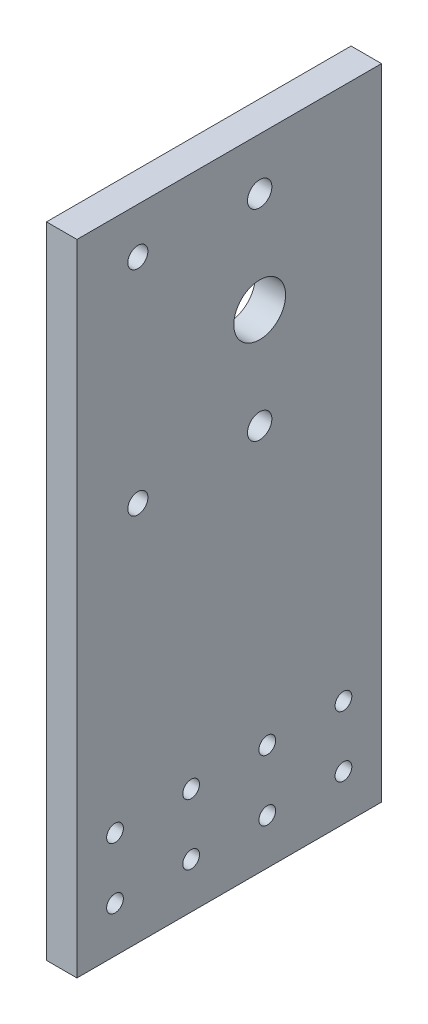
ISO-10303-21;
HEADER;
FILE_DESCRIPTION(('STEP AP214'),'2;1');
FILE_NAME('part.step','',(''),(''),'','','');
FILE_SCHEMA(('AUTOMOTIVE_DESIGN { 1 0 10303 214 1 1 1 1 }'));
ENDSEC;
DATA;
#1=APPLICATION_CONTEXT('core data for automotive mechanical design processes');
#2=APPLICATION_PROTOCOL_DEFINITION('international standard','automotive_design',2000,#1);
#3=PRODUCT_CONTEXT('',#1,'mechanical');
#4=PRODUCT('Part','Part','',(#3));
#5=PRODUCT_RELATED_PRODUCT_CATEGORY('part','',(#4));
#6=PRODUCT_DEFINITION_FORMATION('','',#4);
#7=PRODUCT_DEFINITION_CONTEXT('part definition',#1,'design');
#8=PRODUCT_DEFINITION('design','',#6,#7);
#9=PRODUCT_DEFINITION_SHAPE('','',#8);
#10=(LENGTH_UNIT() NAMED_UNIT(*) SI_UNIT(.MILLI.,.METRE.));
#11=(NAMED_UNIT(*) PLANE_ANGLE_UNIT() SI_UNIT($,.RADIAN.));
#12=(NAMED_UNIT(*) SI_UNIT($,.STERADIAN.) SOLID_ANGLE_UNIT());
#13=UNCERTAINTY_MEASURE_WITH_UNIT(LENGTH_MEASURE(1.E-05),#10,'distance_accuracy_value','');
#14=(GEOMETRIC_REPRESENTATION_CONTEXT(3) GLOBAL_UNCERTAINTY_ASSIGNED_CONTEXT((#13)) GLOBAL_UNIT_ASSIGNED_CONTEXT((#10,
#11,#12)) REPRESENTATION_CONTEXT('',''));
#15=CARTESIAN_POINT('',(0.,0.,0.));
#16=DIRECTION('',(0.,0.,1.));
#17=DIRECTION('',(1.,0.,0.));
#18=AXIS2_PLACEMENT_3D('',#15,#16,#17);
#19=CARTESIAN_POINT('',(0.,0.,0.));
#20=DIRECTION('',(1.,0.,0.));
#21=DIRECTION('',(0.,0.,-1.));
#22=AXIS2_PLACEMENT_3D('',#19,#20,#21);
#23=PLANE('',#22);
#24=CARTESIAN_POINT('',(0.,-70.,-27.5));
#25=DIRECTION('',(-1.,0.,0.));
#26=DIRECTION('',(0.,0.,1.));
#27=AXIS2_PLACEMENT_3D('',#24,#25,#26);
#28=CIRCLE('',#27,5.735);
#29=CARTESIAN_POINT('',(0.,-70.,-21.765));
#30=VERTEX_POINT('',#29);
#31=EDGE_CURVE('E461',#30,#30,#28,.T.);
#32=ORIENTED_EDGE('',*,*,#31,.F.);
#33=EDGE_LOOP('',(#32));
#34=FACE_BOUND('',#33,.T.);
#35=CARTESIAN_POINT('',(0.,22.,0.));
#36=DIRECTION('',(1.,0.,0.));
#37=DIRECTION('',(0.,0.,1.));
#38=AXIS2_PLACEMENT_3D('',#35,#36,#37);
#39=CIRCLE('',#38,4.);
#40=CARTESIAN_POINT('',(0.,22.,4.));
#41=VERTEX_POINT('',#40);
#42=EDGE_CURVE('E203',#41,#41,#39,.T.);
#43=ORIENTED_EDGE('',*,*,#42,.T.);
#44=EDGE_LOOP('',(#43));
#45=FACE_BOUND('',#44,.T.);
#46=CARTESIAN_POINT('',(0.,88.,0.));
#47=DIRECTION('',(1.,0.,0.));
#48=DIRECTION('',(0.,0.,-1.));
#49=AXIS2_PLACEMENT_3D('',#46,#47,#48);
#50=CIRCLE('',#49,4.00000000000001);
#51=CARTESIAN_POINT('',(0.,88.,-4.00000000000001));
#52=VERTEX_POINT('',#51);
#53=EDGE_CURVE('E209',#52,#52,#50,.T.);
#54=ORIENTED_EDGE('',*,*,#53,.T.);
#55=EDGE_LOOP('',(#54));
#56=FACE_BOUND('',#55,.T.);
#57=DIRECTION('',(0.,-1.,0.));
#58=VECTOR('',#57,1.);
#59=CARTESIAN_POINT('',(0.,-105.,60.));
#60=LINE('',#59,#58);
#61=CARTESIAN_POINT('',(0.,105.,60.));
#62=VERTEX_POINT('',#61);
#63=CARTESIAN_POINT('',(0.,-105.,60.));
#64=VERTEX_POINT('',#63);
#65=EDGE_CURVE('E105',#62,#64,#60,.T.);
#66=ORIENTED_EDGE('',*,*,#65,.F.);
#67=DIRECTION('',(0.,0.,1.));
#68=VECTOR('',#67,1.);
#69=CARTESIAN_POINT('',(0.,105.,-40.));
#70=LINE('',#69,#68);
#71=CARTESIAN_POINT('',(0.,105.,-40.));
#72=VERTEX_POINT('',#71);
#73=EDGE_CURVE('E79',#72,#62,#70,.T.);
#74=ORIENTED_EDGE('',*,*,#73,.F.);
#75=DIRECTION('',(0.,1.,0.));
#76=VECTOR('',#75,1.);
#77=CARTESIAN_POINT('',(0.,-105.,-40.));
#78=LINE('',#77,#76);
#79=CARTESIAN_POINT('',(0.,-105.,-40.));
#80=VERTEX_POINT('',#79);
#81=EDGE_CURVE('E73',#80,#72,#78,.T.);
#82=ORIENTED_EDGE('',*,*,#81,.F.);
#83=DIRECTION('',(0.,0.,-1.));
#84=VECTOR('',#83,1.);
#85=CARTESIAN_POINT('',(0.,-105.,-40.));
#86=LINE('',#85,#84);
#87=EDGE_CURVE('E96',#64,#80,#86,.T.);
#88=ORIENTED_EDGE('',*,*,#87,.F.);
#89=EDGE_LOOP('',(#66,#74,#82,#88));
#90=FACE_BOUND('',#89,.T.);
#91=CARTESIAN_POINT('',(0.,55.,0.));
#92=DIRECTION('',(1.,0.,0.));
#93=DIRECTION('',(0.,0.,-1.));
#94=AXIS2_PLACEMENT_3D('',#91,#92,#93);
#95=CIRCLE('',#94,8.5);
#96=CARTESIAN_POINT('',(0.,55.,-8.5));
#97=VERTEX_POINT('',#96);
#98=EDGE_CURVE('E200',#97,#97,#95,.T.);
#99=ORIENTED_EDGE('',*,*,#98,.T.);
#100=EDGE_LOOP('',(#99));
#101=FACE_BOUND('',#100,.T.);
#102=CARTESIAN_POINT('',(0.,19.9999999999999,40.));
#103=DIRECTION('',(-1.,0.,0.));
#104=DIRECTION('',(0.,0.,1.));
#105=AXIS2_PLACEMENT_3D('',#102,#103,#104);
#106=CIRCLE('',#105,6.855);
#107=CARTESIAN_POINT('',(0.,19.9999999999999,46.855));
#108=VERTEX_POINT('',#107);
#109=EDGE_CURVE('E122',#108,#108,#106,.T.);
#110=ORIENTED_EDGE('',*,*,#109,.F.);
#111=EDGE_LOOP('',(#110));
#112=FACE_BOUND('',#111,.T.);
#113=CARTESIAN_POINT('',(0.,90.,40.));
#114=DIRECTION('',(-1.,0.,0.));
#115=DIRECTION('',(0.,0.,1.));
#116=AXIS2_PLACEMENT_3D('',#113,#114,#115);
#117=CIRCLE('',#116,6.855);
#118=CARTESIAN_POINT('',(0.,90.,46.855));
#119=VERTEX_POINT('',#118);
#120=EDGE_CURVE('E127',#119,#119,#117,.T.);
#121=ORIENTED_EDGE('',*,*,#120,.F.);
#122=EDGE_LOOP('',(#121));
#123=FACE_BOUND('',#122,.T.);
#124=CARTESIAN_POINT('',(0.,-90.,-27.5));
#125=DIRECTION('',(-1.,0.,0.));
#126=DIRECTION('',(0.,0.,1.));
#127=AXIS2_PLACEMENT_3D('',#124,#125,#126);
#128=CIRCLE('',#127,5.735);
#129=CARTESIAN_POINT('',(0.,-90.,-21.765));
#130=VERTEX_POINT('',#129);
#131=EDGE_CURVE('E132',#130,#130,#128,.T.);
#132=ORIENTED_EDGE('',*,*,#131,.F.);
#133=EDGE_LOOP('',(#132));
#134=FACE_BOUND('',#133,.T.);
#135=CARTESIAN_POINT('',(0.,-90.,-2.5));
#136=DIRECTION('',(-1.,0.,0.));
#137=DIRECTION('',(0.,0.,1.));
#138=AXIS2_PLACEMENT_3D('',#135,#136,#137);
#139=CIRCLE('',#138,5.735);
#140=CARTESIAN_POINT('',(0.,-90.,3.23500000000001));
#141=VERTEX_POINT('',#140);
#142=EDGE_CURVE('E137',#141,#141,#139,.T.);
#143=ORIENTED_EDGE('',*,*,#142,.F.);
#144=EDGE_LOOP('',(#143));
#145=FACE_BOUND('',#144,.T.);
#146=CARTESIAN_POINT('',(0.,-90.,22.5));
#147=DIRECTION('',(-1.,0.,0.));
#148=DIRECTION('',(0.,0.,1.));
#149=AXIS2_PLACEMENT_3D('',#146,#147,#148);
#150=CIRCLE('',#149,5.735);
#151=CARTESIAN_POINT('',(0.,-90.,28.235));
#152=VERTEX_POINT('',#151);
#153=EDGE_CURVE('E142',#152,#152,#150,.T.);
#154=ORIENTED_EDGE('',*,*,#153,.F.);
#155=EDGE_LOOP('',(#154));
#156=FACE_BOUND('',#155,.T.);
#157=CARTESIAN_POINT('',(0.,-90.,47.5));
#158=DIRECTION('',(-1.,0.,0.));
#159=DIRECTION('',(0.,0.,1.));
#160=AXIS2_PLACEMENT_3D('',#157,#158,#159);
#161=CIRCLE('',#160,5.735);
#162=CARTESIAN_POINT('',(0.,-90.,53.235));
#163=VERTEX_POINT('',#162);
#164=EDGE_CURVE('E147',#163,#163,#161,.T.);
#165=ORIENTED_EDGE('',*,*,#164,.F.);
#166=EDGE_LOOP('',(#165));
#167=FACE_BOUND('',#166,.T.);
#168=CARTESIAN_POINT('',(0.,-70.,47.5));
#169=DIRECTION('',(-1.,0.,0.));
#170=DIRECTION('',(0.,0.,1.));
#171=AXIS2_PLACEMENT_3D('',#168,#169,#170);
#172=CIRCLE('',#171,5.735);
#173=CARTESIAN_POINT('',(0.,-70.,53.235));
#174=VERTEX_POINT('',#173);
#175=EDGE_CURVE('E151',#174,#174,#172,.T.);
#176=ORIENTED_EDGE('',*,*,#175,.F.);
#177=EDGE_LOOP('',(#176));
#178=FACE_BOUND('',#177,.T.);
#179=CARTESIAN_POINT('',(0.,-70.,22.5));
#180=DIRECTION('',(-1.,0.,0.));
#181=DIRECTION('',(0.,0.,1.));
#182=AXIS2_PLACEMENT_3D('',#179,#180,#181);
#183=CIRCLE('',#182,5.735);
#184=CARTESIAN_POINT('',(0.,-70.,28.235));
#185=VERTEX_POINT('',#184);
#186=EDGE_CURVE('E155',#185,#185,#183,.T.);
#187=ORIENTED_EDGE('',*,*,#186,.F.);
#188=EDGE_LOOP('',(#187));
#189=FACE_BOUND('',#188,.T.);
#190=CARTESIAN_POINT('',(0.,-70.,-2.5));
#191=DIRECTION('',(-1.,0.,0.));
#192=DIRECTION('',(0.,0.,1.));
#193=AXIS2_PLACEMENT_3D('',#190,#191,#192);
#194=CIRCLE('',#193,5.735);
#195=CARTESIAN_POINT('',(0.,-70.,3.23500000000001));
#196=VERTEX_POINT('',#195);
#197=EDGE_CURVE('E162',#196,#196,#194,.T.);
#198=ORIENTED_EDGE('',*,*,#197,.F.);
#199=EDGE_LOOP('',(#198));
#200=FACE_BOUND('',#199,.T.);
#201=ADVANCED_FACE('F37',(#34,#45,#56,#90,#101,#112,#123,#134,#145,#156,#167,#178,#189,#200),
#23,.F.);
#202=CARTESIAN_POINT('',(10.,0.,0.));
#203=DIRECTION('',(1.,0.,0.));
#204=DIRECTION('',(0.,0.,-1.));
#205=AXIS2_PLACEMENT_3D('',#202,#203,#204);
#206=PLANE('',#205);
#207=CARTESIAN_POINT('',(10.,-70.,-27.5));
#208=DIRECTION('',(1.,0.,0.));
#209=DIRECTION('',(0.,0.,-1.));
#210=AXIS2_PLACEMENT_3D('',#207,#208,#209);
#211=CIRCLE('',#210,2.75);
#212=CARTESIAN_POINT('',(10.,-70.,-30.25));
#213=VERTEX_POINT('',#212);
#214=EDGE_CURVE('E41',#213,#213,#211,.T.);
#215=ORIENTED_EDGE('',*,*,#214,.F.);
#216=EDGE_LOOP('',(#215));
#217=FACE_BOUND('',#216,.T.);
#218=CARTESIAN_POINT('',(10.,-70.,-2.5));
#219=DIRECTION('',(1.,0.,0.));
#220=DIRECTION('',(0.,0.,-1.));
#221=AXIS2_PLACEMENT_3D('',#218,#219,#220);
#222=CIRCLE('',#221,2.75);
#223=CARTESIAN_POINT('',(10.,-70.,-5.25));
#224=VERTEX_POINT('',#223);
#225=EDGE_CURVE('E153',#224,#224,#222,.T.);
#226=ORIENTED_EDGE('',*,*,#225,.F.);
#227=EDGE_LOOP('',(#226));
#228=FACE_BOUND('',#227,.T.);
#229=CARTESIAN_POINT('',(10.,-70.,22.5));
#230=DIRECTION('',(1.,0.,0.));
#231=DIRECTION('',(0.,0.,-1.));
#232=AXIS2_PLACEMENT_3D('',#229,#230,#231);
#233=CIRCLE('',#232,2.75);
#234=CARTESIAN_POINT('',(10.,-70.,19.75));
#235=VERTEX_POINT('',#234);
#236=EDGE_CURVE('E149',#235,#235,#233,.T.);
#237=ORIENTED_EDGE('',*,*,#236,.F.);
#238=EDGE_LOOP('',(#237));
#239=FACE_BOUND('',#238,.T.);
#240=CARTESIAN_POINT('',(10.,-70.,47.5));
#241=DIRECTION('',(1.,0.,0.));
#242=DIRECTION('',(0.,0.,-1.));
#243=AXIS2_PLACEMENT_3D('',#240,#241,#242);
#244=CIRCLE('',#243,2.75);
#245=CARTESIAN_POINT('',(10.,-70.,44.75));
#246=VERTEX_POINT('',#245);
#247=EDGE_CURVE('E144',#246,#246,#244,.T.);
#248=ORIENTED_EDGE('',*,*,#247,.F.);
#249=EDGE_LOOP('',(#248));
#250=FACE_BOUND('',#249,.T.);
#251=CARTESIAN_POINT('',(10.,-90.,47.5));
#252=DIRECTION('',(1.,0.,0.));
#253=DIRECTION('',(0.,0.,-1.));
#254=AXIS2_PLACEMENT_3D('',#251,#252,#253);
#255=CIRCLE('',#254,2.75);
#256=CARTESIAN_POINT('',(10.,-90.,44.75));
#257=VERTEX_POINT('',#256);
#258=EDGE_CURVE('E139',#257,#257,#255,.T.);
#259=ORIENTED_EDGE('',*,*,#258,.F.);
#260=EDGE_LOOP('',(#259));
#261=FACE_BOUND('',#260,.T.);
#262=CARTESIAN_POINT('',(10.,-90.,22.5));
#263=DIRECTION('',(1.,0.,0.));
#264=DIRECTION('',(0.,0.,-1.));
#265=AXIS2_PLACEMENT_3D('',#262,#263,#264);
#266=CIRCLE('',#265,2.75);
#267=CARTESIAN_POINT('',(10.,-90.,19.75));
#268=VERTEX_POINT('',#267);
#269=EDGE_CURVE('E134',#268,#268,#266,.T.);
#270=ORIENTED_EDGE('',*,*,#269,.F.);
#271=EDGE_LOOP('',(#270));
#272=FACE_BOUND('',#271,.T.);
#273=CARTESIAN_POINT('',(10.,-90.,-2.5));
#274=DIRECTION('',(1.,0.,0.));
#275=DIRECTION('',(0.,0.,-1.));
#276=AXIS2_PLACEMENT_3D('',#273,#274,#275);
#277=CIRCLE('',#276,2.75);
#278=CARTESIAN_POINT('',(10.,-90.,-5.25));
#279=VERTEX_POINT('',#278);
#280=EDGE_CURVE('E129',#279,#279,#277,.T.);
#281=ORIENTED_EDGE('',*,*,#280,.F.);
#282=EDGE_LOOP('',(#281));
#283=FACE_BOUND('',#282,.T.);
#284=CARTESIAN_POINT('',(10.,-90.,-27.5));
#285=DIRECTION('',(1.,0.,0.));
#286=DIRECTION('',(0.,0.,-1.));
#287=AXIS2_PLACEMENT_3D('',#284,#285,#286);
#288=CIRCLE('',#287,2.75);
#289=CARTESIAN_POINT('',(10.,-90.,-30.25));
#290=VERTEX_POINT('',#289);
#291=EDGE_CURVE('E124',#290,#290,#288,.T.);
#292=ORIENTED_EDGE('',*,*,#291,.F.);
#293=EDGE_LOOP('',(#292));
#294=FACE_BOUND('',#293,.T.);
#295=CARTESIAN_POINT('',(10.,90.,40.));
#296=DIRECTION('',(1.,0.,0.));
#297=DIRECTION('',(0.,0.,-1.));
#298=AXIS2_PLACEMENT_3D('',#295,#296,#297);
#299=CIRCLE('',#298,3.3);
#300=CARTESIAN_POINT('',(10.,90.,36.7));
#301=VERTEX_POINT('',#300);
#302=EDGE_CURVE('E119',#301,#301,#299,.T.);
#303=ORIENTED_EDGE('',*,*,#302,.F.);
#304=EDGE_LOOP('',(#303));
#305=FACE_BOUND('',#304,.T.);
#306=CARTESIAN_POINT('',(10.,19.9999999999999,40.));
#307=DIRECTION('',(1.,0.,0.));
#308=DIRECTION('',(0.,0.,-1.));
#309=AXIS2_PLACEMENT_3D('',#306,#307,#308);
#310=CIRCLE('',#309,3.3);
#311=CARTESIAN_POINT('',(10.,19.9999999999999,36.7));
#312=VERTEX_POINT('',#311);
#313=EDGE_CURVE('E114',#312,#312,#310,.T.);
#314=ORIENTED_EDGE('',*,*,#313,.F.);
#315=EDGE_LOOP('',(#314));
#316=FACE_BOUND('',#315,.T.);
#317=CARTESIAN_POINT('',(10.,55.,0.));
#318=DIRECTION('',(1.,0.,0.));
#319=DIRECTION('',(0.,0.,-1.));
#320=AXIS2_PLACEMENT_3D('',#317,#318,#319);
#321=CIRCLE('',#320,8.5);
#322=CARTESIAN_POINT('',(10.,55.,-8.5));
#323=VERTEX_POINT('',#322);
#324=EDGE_CURVE('E117',#323,#323,#321,.T.);
#325=ORIENTED_EDGE('',*,*,#324,.F.);
#326=EDGE_LOOP('',(#325));
#327=FACE_BOUND('',#326,.T.);
#328=CARTESIAN_POINT('',(10.,88.,0.));
#329=DIRECTION('',(1.,0.,0.));
#330=DIRECTION('',(0.,0.,-1.));
#331=AXIS2_PLACEMENT_3D('',#328,#329,#330);
#332=CIRCLE('',#331,4.00000000000001);
#333=CARTESIAN_POINT('',(10.,88.,-4.00000000000001));
#334=VERTEX_POINT('',#333);
#335=EDGE_CURVE('E108',#334,#334,#332,.T.);
#336=ORIENTED_EDGE('',*,*,#335,.F.);
#337=EDGE_LOOP('',(#336));
#338=FACE_BOUND('',#337,.T.);
#339=DIRECTION('',(0.,-1.,0.));
#340=VECTOR('',#339,1.);
#341=CARTESIAN_POINT('',(10.,-105.,60.));
#342=LINE('',#341,#340);
#343=CARTESIAN_POINT('',(10.,105.,60.));
#344=VERTEX_POINT('',#343);
#345=CARTESIAN_POINT('',(10.,-105.,60.));
#346=VERTEX_POINT('',#345);
#347=EDGE_CURVE('E92',#344,#346,#342,.T.);
#348=ORIENTED_EDGE('',*,*,#347,.T.);
#349=DIRECTION('',(0.,0.,-1.));
#350=VECTOR('',#349,1.);
#351=CARTESIAN_POINT('',(10.,-105.,-40.));
#352=LINE('',#351,#350);
#353=CARTESIAN_POINT('',(10.,-105.,-40.));
#354=VERTEX_POINT('',#353);
#355=EDGE_CURVE('E86',#346,#354,#352,.T.);
#356=ORIENTED_EDGE('',*,*,#355,.T.);
#357=DIRECTION('',(0.,1.,0.));
#358=VECTOR('',#357,1.);
#359=CARTESIAN_POINT('',(10.,-105.,-40.));
#360=LINE('',#359,#358);
#361=CARTESIAN_POINT('',(10.,105.,-40.));
#362=VERTEX_POINT('',#361);
#363=EDGE_CURVE('E90',#354,#362,#360,.T.);
#364=ORIENTED_EDGE('',*,*,#363,.T.);
#365=DIRECTION('',(0.,0.,1.));
#366=VECTOR('',#365,1.);
#367=CARTESIAN_POINT('',(10.,105.,-40.));
#368=LINE('',#367,#366);
#369=EDGE_CURVE('E56',#362,#344,#368,.T.);
#370=ORIENTED_EDGE('',*,*,#369,.T.);
#371=EDGE_LOOP('',(#348,#356,#364,#370));
#372=FACE_BOUND('',#371,.T.);
#373=CARTESIAN_POINT('',(10.,22.,0.));
#374=DIRECTION('',(1.,0.,0.));
#375=DIRECTION('',(0.,0.,1.));
#376=AXIS2_PLACEMENT_3D('',#373,#374,#375);
#377=CIRCLE('',#376,4.);
#378=CARTESIAN_POINT('',(10.,22.,4.));
#379=VERTEX_POINT('',#378);
#380=EDGE_CURVE('E206',#379,#379,#377,.T.);
#381=ORIENTED_EDGE('',*,*,#380,.F.);
#382=EDGE_LOOP('',(#381));
#383=FACE_BOUND('',#382,.T.);
#384=ADVANCED_FACE('F87',(#217,#228,#239,#250,#261,#272,#283,#294,#305,#316,#327,#338,#372,
#383),#206,.T.);
#385=CARTESIAN_POINT('',(10.,-105.,60.));
#386=DIRECTION('',(0.,0.,-1.));
#387=DIRECTION('',(-1.,0.,0.));
#388=AXIS2_PLACEMENT_3D('',#385,#386,#387);
#389=PLANE('',#388);
#390=ORIENTED_EDGE('',*,*,#65,.T.);
#391=DIRECTION('',(-1.,0.,0.));
#392=VECTOR('',#391,1.);
#393=CARTESIAN_POINT('',(10.,-105.,60.));
#394=LINE('',#393,#392);
#395=EDGE_CURVE('E11',#346,#64,#394,.T.);
#396=ORIENTED_EDGE('',*,*,#395,.F.);
#397=ORIENTED_EDGE('',*,*,#347,.F.);
#398=DIRECTION('',(-1.,0.,0.));
#399=VECTOR('',#398,1.);
#400=CARTESIAN_POINT('',(10.,105.,60.));
#401=LINE('',#400,#399);
#402=EDGE_CURVE('E101',#344,#62,#401,.T.);
#403=ORIENTED_EDGE('',*,*,#402,.T.);
#404=EDGE_LOOP('',(#390,#396,#397,#403));
#405=FACE_BOUND('',#404,.T.);
#406=ADVANCED_FACE('F39',(#405),#389,.F.);
#407=CARTESIAN_POINT('',(10.,-105.,-40.));
#408=DIRECTION('',(0.,1.,0.));
#409=DIRECTION('',(0.,0.,1.));
#410=AXIS2_PLACEMENT_3D('',#407,#408,#409);
#411=PLANE('',#410);
#412=ORIENTED_EDGE('',*,*,#87,.T.);
#413=DIRECTION('',(-1.,0.,0.));
#414=VECTOR('',#413,1.);
#415=CARTESIAN_POINT('',(10.,-105.,-40.));
#416=LINE('',#415,#414);
#417=EDGE_CURVE('E47',#354,#80,#416,.T.);
#418=ORIENTED_EDGE('',*,*,#417,.F.);
#419=ORIENTED_EDGE('',*,*,#355,.F.);
#420=ORIENTED_EDGE('',*,*,#395,.T.);
#421=EDGE_LOOP('',(#412,#418,#419,#420));
#422=FACE_BOUND('',#421,.T.);
#423=ADVANCED_FACE('F95',(#422),#411,.F.);
#424=CARTESIAN_POINT('',(10.,-105.,-40.));
#425=DIRECTION('',(0.,0.,1.));
#426=DIRECTION('',(1.,0.,0.));
#427=AXIS2_PLACEMENT_3D('',#424,#425,#426);
#428=PLANE('',#427);
#429=ORIENTED_EDGE('',*,*,#81,.T.);
#430=DIRECTION('',(-1.,0.,0.));
#431=VECTOR('',#430,1.);
#432=CARTESIAN_POINT('',(10.,105.,-40.));
#433=LINE('',#432,#431);
#434=EDGE_CURVE('E97',#362,#72,#433,.T.);
#435=ORIENTED_EDGE('',*,*,#434,.F.);
#436=ORIENTED_EDGE('',*,*,#363,.F.);
#437=ORIENTED_EDGE('',*,*,#417,.T.);
#438=EDGE_LOOP('',(#429,#435,#436,#437));
#439=FACE_BOUND('',#438,.T.);
#440=ADVANCED_FACE('F99',(#439),#428,.F.);
#441=CARTESIAN_POINT('',(10.,105.,-40.));
#442=DIRECTION('',(0.,-1.,0.));
#443=DIRECTION('',(0.,0.,-1.));
#444=AXIS2_PLACEMENT_3D('',#441,#442,#443);
#445=PLANE('',#444);
#446=ORIENTED_EDGE('',*,*,#73,.T.);
#447=ORIENTED_EDGE('',*,*,#402,.F.);
#448=ORIENTED_EDGE('',*,*,#369,.F.);
#449=ORIENTED_EDGE('',*,*,#434,.T.);
#450=EDGE_LOOP('',(#446,#447,#448,#449));
#451=FACE_BOUND('',#450,.T.);
#452=ADVANCED_FACE('F222',(#451),#445,.F.);
#453=CARTESIAN_POINT('',(10.,88.,0.));
#454=DIRECTION('',(-1.,0.,0.));
#455=DIRECTION('',(0.,0.,1.));
#456=AXIS2_PLACEMENT_3D('',#453,#454,#455);
#457=CYLINDRICAL_SURFACE('',#456,4.00000000000001);
#458=ORIENTED_EDGE('',*,*,#335,.T.);
#459=EDGE_LOOP('',(#458));
#460=FACE_BOUND('',#459,.T.);
#461=ORIENTED_EDGE('',*,*,#53,.F.);
#462=EDGE_LOOP('',(#461));
#463=FACE_BOUND('',#462,.T.);
#464=ADVANCED_FACE('F219',(#460,#463),#457,.F.);
#465=CARTESIAN_POINT('',(10.,22.,0.));
#466=DIRECTION('',(-1.,0.,0.));
#467=DIRECTION('',(0.,0.,1.));
#468=AXIS2_PLACEMENT_3D('',#465,#466,#467);
#469=CYLINDRICAL_SURFACE('',#468,4.);
#470=ORIENTED_EDGE('',*,*,#380,.T.);
#471=EDGE_LOOP('',(#470));
#472=FACE_BOUND('',#471,.T.);
#473=ORIENTED_EDGE('',*,*,#42,.F.);
#474=EDGE_LOOP('',(#473));
#475=FACE_BOUND('',#474,.T.);
#476=ADVANCED_FACE('F221',(#472,#475),#469,.F.);
#477=CARTESIAN_POINT('',(0.,55.,0.));
#478=DIRECTION('',(1.,0.,0.));
#479=DIRECTION('',(0.,0.,-1.));
#480=AXIS2_PLACEMENT_3D('',#477,#478,#479);
#481=CYLINDRICAL_SURFACE('',#480,8.5);
#482=ORIENTED_EDGE('',*,*,#98,.F.);
#483=EDGE_LOOP('',(#482));
#484=FACE_BOUND('',#483,.T.);
#485=ORIENTED_EDGE('',*,*,#324,.T.);
#486=EDGE_LOOP('',(#485));
#487=FACE_BOUND('',#486,.T.);
#488=ADVANCED_FACE('F229',(#484,#487),#481,.F.);
#489=CARTESIAN_POINT('',(0.,19.9999999999999,40.));
#490=DIRECTION('',(-1.,0.,0.));
#491=DIRECTION('',(0.,0.,1.));
#492=AXIS2_PLACEMENT_3D('',#489,#490,#491);
#493=CYLINDRICAL_SURFACE('',#492,3.3);
#494=ORIENTED_EDGE('',*,*,#313,.T.);
#495=EDGE_LOOP('',(#494));
#496=FACE_BOUND('',#495,.T.);
#497=CARTESIAN_POINT('',(3.555,19.9999999999999,40.));
#498=DIRECTION('',(-1.,0.,0.));
#499=DIRECTION('',(0.,0.,1.));
#500=AXIS2_PLACEMENT_3D('',#497,#498,#499);
#501=CIRCLE('',#500,3.3);
#502=CARTESIAN_POINT('',(3.555,19.9999999999999,43.3));
#503=VERTEX_POINT('',#502);
#504=EDGE_CURVE('E118',#503,#503,#501,.T.);
#505=ORIENTED_EDGE('',*,*,#504,.T.);
#506=EDGE_LOOP('',(#505));
#507=FACE_BOUND('',#506,.T.);
#508=ADVANCED_FACE('F349',(#496,#507),#493,.F.);
#509=CARTESIAN_POINT('',(0.,19.9999999999999,40.));
#510=DIRECTION('',(-1.,0.,0.));
#511=DIRECTION('',(0.,0.,1.));
#512=AXIS2_PLACEMENT_3D('',#509,#510,#511);
#513=CONICAL_SURFACE('',#512,6.855,0.785398163397448);
#514=ORIENTED_EDGE('',*,*,#504,.F.);
#515=EDGE_LOOP('',(#514));
#516=FACE_BOUND('',#515,.T.);
#517=ORIENTED_EDGE('',*,*,#109,.T.);
#518=EDGE_LOOP('',(#517));
#519=FACE_BOUND('',#518,.T.);
#520=ADVANCED_FACE('F345',(#516,#519),#513,.F.);
#521=CARTESIAN_POINT('',(0.,90.,40.));
#522=DIRECTION('',(-1.,0.,0.));
#523=DIRECTION('',(0.,0.,1.));
#524=AXIS2_PLACEMENT_3D('',#521,#522,#523);
#525=CYLINDRICAL_SURFACE('',#524,3.3);
#526=ORIENTED_EDGE('',*,*,#302,.T.);
#527=EDGE_LOOP('',(#526));
#528=FACE_BOUND('',#527,.T.);
#529=CARTESIAN_POINT('',(3.555,90.,40.));
#530=DIRECTION('',(-1.,0.,0.));
#531=DIRECTION('',(0.,0.,1.));
#532=AXIS2_PLACEMENT_3D('',#529,#530,#531);
#533=CIRCLE('',#532,3.3);
#534=CARTESIAN_POINT('',(3.555,90.,43.3));
#535=VERTEX_POINT('',#534);
#536=EDGE_CURVE('E123',#535,#535,#533,.T.);
#537=ORIENTED_EDGE('',*,*,#536,.T.);
#538=EDGE_LOOP('',(#537));
#539=FACE_BOUND('',#538,.T.);
#540=ADVANCED_FACE('F341',(#528,#539),#525,.F.);
#541=CARTESIAN_POINT('',(0.,90.,40.));
#542=DIRECTION('',(-1.,0.,0.));
#543=DIRECTION('',(0.,0.,1.));
#544=AXIS2_PLACEMENT_3D('',#541,#542,#543);
#545=CONICAL_SURFACE('',#544,6.855,0.785398163397448);
#546=ORIENTED_EDGE('',*,*,#536,.F.);
#547=EDGE_LOOP('',(#546));
#548=FACE_BOUND('',#547,.T.);
#549=ORIENTED_EDGE('',*,*,#120,.T.);
#550=EDGE_LOOP('',(#549));
#551=FACE_BOUND('',#550,.T.);
#552=ADVANCED_FACE('F337',(#548,#551),#545,.F.);
#553=CARTESIAN_POINT('',(0.,-90.,-27.5));
#554=DIRECTION('',(-1.,0.,0.));
#555=DIRECTION('',(0.,0.,1.));
#556=AXIS2_PLACEMENT_3D('',#553,#554,#555);
#557=CYLINDRICAL_SURFACE('',#556,2.75);
#558=ORIENTED_EDGE('',*,*,#291,.T.);
#559=EDGE_LOOP('',(#558));
#560=FACE_BOUND('',#559,.T.);
#561=CARTESIAN_POINT('',(2.985,-90.,-27.5));
#562=DIRECTION('',(-1.,0.,0.));
#563=DIRECTION('',(0.,0.,1.));
#564=AXIS2_PLACEMENT_3D('',#561,#562,#563);
#565=CIRCLE('',#564,2.75);
#566=CARTESIAN_POINT('',(2.985,-90.,-24.75));
#567=VERTEX_POINT('',#566);
#568=EDGE_CURVE('E128',#567,#567,#565,.T.);
#569=ORIENTED_EDGE('',*,*,#568,.T.);
#570=EDGE_LOOP('',(#569));
#571=FACE_BOUND('',#570,.T.);
#572=ADVANCED_FACE('F333',(#560,#571),#557,.F.);
#573=CARTESIAN_POINT('',(0.,-90.,-27.5));
#574=DIRECTION('',(-1.,0.,0.));
#575=DIRECTION('',(0.,0.,1.));
#576=AXIS2_PLACEMENT_3D('',#573,#574,#575);
#577=CONICAL_SURFACE('',#576,5.735,0.785398163397448);
#578=ORIENTED_EDGE('',*,*,#568,.F.);
#579=EDGE_LOOP('',(#578));
#580=FACE_BOUND('',#579,.T.);
#581=ORIENTED_EDGE('',*,*,#131,.T.);
#582=EDGE_LOOP('',(#581));
#583=FACE_BOUND('',#582,.T.);
#584=ADVANCED_FACE('F329',(#580,#583),#577,.F.);
#585=CARTESIAN_POINT('',(0.,-90.,-2.5));
#586=DIRECTION('',(-1.,0.,0.));
#587=DIRECTION('',(0.,0.,1.));
#588=AXIS2_PLACEMENT_3D('',#585,#586,#587);
#589=CYLINDRICAL_SURFACE('',#588,2.75);
#590=ORIENTED_EDGE('',*,*,#280,.T.);
#591=EDGE_LOOP('',(#590));
#592=FACE_BOUND('',#591,.T.);
#593=CARTESIAN_POINT('',(2.985,-90.,-2.5));
#594=DIRECTION('',(-1.,0.,0.));
#595=DIRECTION('',(0.,0.,1.));
#596=AXIS2_PLACEMENT_3D('',#593,#594,#595);
#597=CIRCLE('',#596,2.75);
#598=CARTESIAN_POINT('',(2.985,-90.,0.250000000000007));
#599=VERTEX_POINT('',#598);
#600=EDGE_CURVE('E133',#599,#599,#597,.T.);
#601=ORIENTED_EDGE('',*,*,#600,.T.);
#602=EDGE_LOOP('',(#601));
#603=FACE_BOUND('',#602,.T.);
#604=ADVANCED_FACE('F325',(#592,#603),#589,.F.);
#605=CARTESIAN_POINT('',(0.,-90.,-2.5));
#606=DIRECTION('',(-1.,0.,0.));
#607=DIRECTION('',(0.,0.,1.));
#608=AXIS2_PLACEMENT_3D('',#605,#606,#607);
#609=CONICAL_SURFACE('',#608,5.735,0.785398163397448);
#610=ORIENTED_EDGE('',*,*,#600,.F.);
#611=EDGE_LOOP('',(#610));
#612=FACE_BOUND('',#611,.T.);
#613=ORIENTED_EDGE('',*,*,#142,.T.);
#614=EDGE_LOOP('',(#613));
#615=FACE_BOUND('',#614,.T.);
#616=ADVANCED_FACE('F321',(#612,#615),#609,.F.);
#617=CARTESIAN_POINT('',(0.,-90.,22.5));
#618=DIRECTION('',(-1.,0.,0.));
#619=DIRECTION('',(0.,0.,1.));
#620=AXIS2_PLACEMENT_3D('',#617,#618,#619);
#621=CYLINDRICAL_SURFACE('',#620,2.75);
#622=ORIENTED_EDGE('',*,*,#269,.T.);
#623=EDGE_LOOP('',(#622));
#624=FACE_BOUND('',#623,.T.);
#625=CARTESIAN_POINT('',(2.985,-90.,22.5));
#626=DIRECTION('',(-1.,0.,0.));
#627=DIRECTION('',(0.,0.,1.));
#628=AXIS2_PLACEMENT_3D('',#625,#626,#627);
#629=CIRCLE('',#628,2.75);
#630=CARTESIAN_POINT('',(2.985,-90.,25.25));
#631=VERTEX_POINT('',#630);
#632=EDGE_CURVE('E138',#631,#631,#629,.T.);
#633=ORIENTED_EDGE('',*,*,#632,.T.);
#634=EDGE_LOOP('',(#633));
#635=FACE_BOUND('',#634,.T.);
#636=ADVANCED_FACE('F317',(#624,#635),#621,.F.);
#637=CARTESIAN_POINT('',(0.,-90.,22.5));
#638=DIRECTION('',(-1.,0.,0.));
#639=DIRECTION('',(0.,0.,1.));
#640=AXIS2_PLACEMENT_3D('',#637,#638,#639);
#641=CONICAL_SURFACE('',#640,5.735,0.785398163397448);
#642=ORIENTED_EDGE('',*,*,#632,.F.);
#643=EDGE_LOOP('',(#642));
#644=FACE_BOUND('',#643,.T.);
#645=ORIENTED_EDGE('',*,*,#153,.T.);
#646=EDGE_LOOP('',(#645));
#647=FACE_BOUND('',#646,.T.);
#648=ADVANCED_FACE('F313',(#644,#647),#641,.F.);
#649=CARTESIAN_POINT('',(0.,-90.,47.5));
#650=DIRECTION('',(-1.,0.,0.));
#651=DIRECTION('',(0.,0.,1.));
#652=AXIS2_PLACEMENT_3D('',#649,#650,#651);
#653=CYLINDRICAL_SURFACE('',#652,2.75);
#654=ORIENTED_EDGE('',*,*,#258,.T.);
#655=EDGE_LOOP('',(#654));
#656=FACE_BOUND('',#655,.T.);
#657=CARTESIAN_POINT('',(2.985,-90.,47.5));
#658=DIRECTION('',(-1.,0.,0.));
#659=DIRECTION('',(0.,0.,1.));
#660=AXIS2_PLACEMENT_3D('',#657,#658,#659);
#661=CIRCLE('',#660,2.75);
#662=CARTESIAN_POINT('',(2.985,-90.,50.25));
#663=VERTEX_POINT('',#662);
#664=EDGE_CURVE('E143',#663,#663,#661,.T.);
#665=ORIENTED_EDGE('',*,*,#664,.T.);
#666=EDGE_LOOP('',(#665));
#667=FACE_BOUND('',#666,.T.);
#668=ADVANCED_FACE('F309',(#656,#667),#653,.F.);
#669=CARTESIAN_POINT('',(0.,-90.,47.5));
#670=DIRECTION('',(-1.,0.,0.));
#671=DIRECTION('',(0.,0.,1.));
#672=AXIS2_PLACEMENT_3D('',#669,#670,#671);
#673=CONICAL_SURFACE('',#672,5.735,0.785398163397448);
#674=ORIENTED_EDGE('',*,*,#664,.F.);
#675=EDGE_LOOP('',(#674));
#676=FACE_BOUND('',#675,.T.);
#677=ORIENTED_EDGE('',*,*,#164,.T.);
#678=EDGE_LOOP('',(#677));
#679=FACE_BOUND('',#678,.T.);
#680=ADVANCED_FACE('F305',(#676,#679),#673,.F.);
#681=CARTESIAN_POINT('',(0.,-70.,47.5));
#682=DIRECTION('',(-1.,0.,0.));
#683=DIRECTION('',(0.,0.,1.));
#684=AXIS2_PLACEMENT_3D('',#681,#682,#683);
#685=CYLINDRICAL_SURFACE('',#684,2.75);
#686=ORIENTED_EDGE('',*,*,#247,.T.);
#687=EDGE_LOOP('',(#686));
#688=FACE_BOUND('',#687,.T.);
#689=CARTESIAN_POINT('',(2.985,-70.,47.5));
#690=DIRECTION('',(-1.,0.,0.));
#691=DIRECTION('',(0.,0.,1.));
#692=AXIS2_PLACEMENT_3D('',#689,#690,#691);
#693=CIRCLE('',#692,2.75);
#694=CARTESIAN_POINT('',(2.985,-70.,50.25));
#695=VERTEX_POINT('',#694);
#696=EDGE_CURVE('E148',#695,#695,#693,.T.);
#697=ORIENTED_EDGE('',*,*,#696,.T.);
#698=EDGE_LOOP('',(#697));
#699=FACE_BOUND('',#698,.T.);
#700=ADVANCED_FACE('F301',(#688,#699),#685,.F.);
#701=CARTESIAN_POINT('',(0.,-70.,47.5));
#702=DIRECTION('',(-1.,0.,0.));
#703=DIRECTION('',(0.,0.,1.));
#704=AXIS2_PLACEMENT_3D('',#701,#702,#703);
#705=CONICAL_SURFACE('',#704,5.735,0.785398163397448);
#706=ORIENTED_EDGE('',*,*,#696,.F.);
#707=EDGE_LOOP('',(#706));
#708=FACE_BOUND('',#707,.T.);
#709=ORIENTED_EDGE('',*,*,#175,.T.);
#710=EDGE_LOOP('',(#709));
#711=FACE_BOUND('',#710,.T.);
#712=ADVANCED_FACE('F297',(#708,#711),#705,.F.);
#713=CARTESIAN_POINT('',(0.,-70.,22.5));
#714=DIRECTION('',(-1.,0.,0.));
#715=DIRECTION('',(0.,0.,1.));
#716=AXIS2_PLACEMENT_3D('',#713,#714,#715);
#717=CYLINDRICAL_SURFACE('',#716,2.75);
#718=ORIENTED_EDGE('',*,*,#236,.T.);
#719=EDGE_LOOP('',(#718));
#720=FACE_BOUND('',#719,.T.);
#721=CARTESIAN_POINT('',(2.985,-70.,22.5));
#722=DIRECTION('',(-1.,0.,0.));
#723=DIRECTION('',(0.,0.,1.));
#724=AXIS2_PLACEMENT_3D('',#721,#722,#723);
#725=CIRCLE('',#724,2.75);
#726=CARTESIAN_POINT('',(2.985,-70.,25.25));
#727=VERTEX_POINT('',#726);
#728=EDGE_CURVE('E152',#727,#727,#725,.T.);
#729=ORIENTED_EDGE('',*,*,#728,.T.);
#730=EDGE_LOOP('',(#729));
#731=FACE_BOUND('',#730,.T.);
#732=ADVANCED_FACE('F293',(#720,#731),#717,.F.);
#733=CARTESIAN_POINT('',(0.,-70.,22.5));
#734=DIRECTION('',(-1.,0.,0.));
#735=DIRECTION('',(0.,0.,1.));
#736=AXIS2_PLACEMENT_3D('',#733,#734,#735);
#737=CONICAL_SURFACE('',#736,5.735,0.785398163397448);
#738=ORIENTED_EDGE('',*,*,#728,.F.);
#739=EDGE_LOOP('',(#738));
#740=FACE_BOUND('',#739,.T.);
#741=ORIENTED_EDGE('',*,*,#186,.T.);
#742=EDGE_LOOP('',(#741));
#743=FACE_BOUND('',#742,.T.);
#744=ADVANCED_FACE('F287',(#740,#743),#737,.F.);
#745=CARTESIAN_POINT('',(0.,-70.,-2.5));
#746=DIRECTION('',(-1.,0.,0.));
#747=DIRECTION('',(0.,0.,1.));
#748=AXIS2_PLACEMENT_3D('',#745,#746,#747);
#749=CYLINDRICAL_SURFACE('',#748,2.75);
#750=ORIENTED_EDGE('',*,*,#225,.T.);
#751=EDGE_LOOP('',(#750));
#752=FACE_BOUND('',#751,.T.);
#753=CARTESIAN_POINT('',(2.985,-70.,-2.5));
#754=DIRECTION('',(-1.,0.,0.));
#755=DIRECTION('',(0.,0.,1.));
#756=AXIS2_PLACEMENT_3D('',#753,#754,#755);
#757=CIRCLE('',#756,2.75);
#758=CARTESIAN_POINT('',(2.985,-70.,0.250000000000004));
#759=VERTEX_POINT('',#758);
#760=EDGE_CURVE('E156',#759,#759,#757,.T.);
#761=ORIENTED_EDGE('',*,*,#760,.T.);
#762=EDGE_LOOP('',(#761));
#763=FACE_BOUND('',#762,.T.);
#764=ADVANCED_FACE('F277',(#752,#763),#749,.F.);
#765=CARTESIAN_POINT('',(0.,-70.,-2.5));
#766=DIRECTION('',(-1.,0.,0.));
#767=DIRECTION('',(0.,0.,1.));
#768=AXIS2_PLACEMENT_3D('',#765,#766,#767);
#769=CONICAL_SURFACE('',#768,5.735,0.785398163397448);
#770=ORIENTED_EDGE('',*,*,#760,.F.);
#771=EDGE_LOOP('',(#770));
#772=FACE_BOUND('',#771,.T.);
#773=ORIENTED_EDGE('',*,*,#197,.T.);
#774=EDGE_LOOP('',(#773));
#775=FACE_BOUND('',#774,.T.);
#776=ADVANCED_FACE('F274',(#772,#775),#769,.F.);
#777=CARTESIAN_POINT('',(0.,-70.,-27.5));
#778=DIRECTION('',(-1.,0.,0.));
#779=DIRECTION('',(0.,0.,1.));
#780=AXIS2_PLACEMENT_3D('',#777,#778,#779);
#781=CYLINDRICAL_SURFACE('',#780,2.75);
#782=ORIENTED_EDGE('',*,*,#214,.T.);
#783=EDGE_LOOP('',(#782));
#784=FACE_BOUND('',#783,.T.);
#785=CARTESIAN_POINT('',(2.985,-70.,-27.5));
#786=DIRECTION('',(-1.,0.,0.));
#787=DIRECTION('',(0.,0.,1.));
#788=AXIS2_PLACEMENT_3D('',#785,#786,#787);
#789=CIRCLE('',#788,2.75);
#790=CARTESIAN_POINT('',(2.985,-70.,-24.75));
#791=VERTEX_POINT('',#790);
#792=EDGE_CURVE('E459',#791,#791,#789,.T.);
#793=ORIENTED_EDGE('',*,*,#792,.T.);
#794=EDGE_LOOP('',(#793));
#795=FACE_BOUND('',#794,.T.);
#796=ADVANCED_FACE('F276',(#784,#795),#781,.F.);
#797=CARTESIAN_POINT('',(0.,-70.,-27.5));
#798=DIRECTION('',(-1.,0.,0.));
#799=DIRECTION('',(0.,0.,1.));
#800=AXIS2_PLACEMENT_3D('',#797,#798,#799);
#801=CONICAL_SURFACE('',#800,5.735,0.785398163397448);
#802=ORIENTED_EDGE('',*,*,#792,.F.);
#803=EDGE_LOOP('',(#802));
#804=FACE_BOUND('',#803,.T.);
#805=ORIENTED_EDGE('',*,*,#31,.T.);
#806=EDGE_LOOP('',(#805));
#807=FACE_BOUND('',#806,.T.);
#808=ADVANCED_FACE('F284',(#804,#807),#801,.F.);
#809=CLOSED_SHELL('',(#201,#384,#406,#423,#440,#452,#464,#476,#488,#508,#520,#540,#552,#572,
#584,#604,#616,#636,#648,#668,#680,#700,#712,#732,#744,#764,#776,#796,#808));
#810=MANIFOLD_SOLID_BREP('B2',#809);
#811=ADVANCED_BREP_SHAPE_REPRESENTATION('',(#18,#810),#14);
#812=SHAPE_DEFINITION_REPRESENTATION(#9,#811);
ENDSEC;
END-ISO-10303-21;
